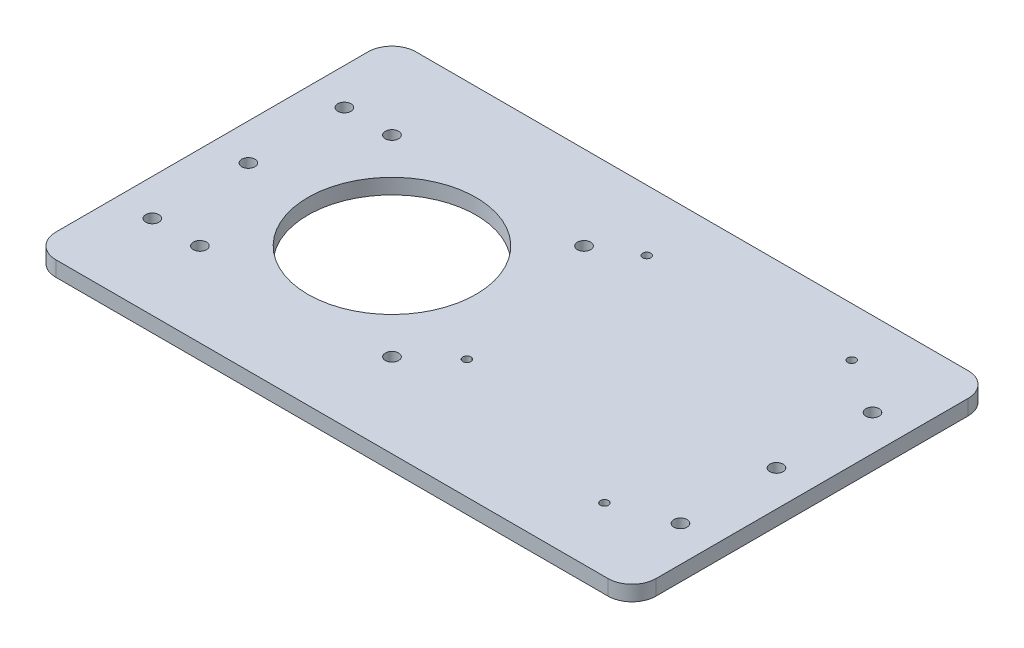
ISO-10303-21;
HEADER;
FILE_DESCRIPTION(('STEP AP214'),'2;1');
FILE_NAME('part.step','',(''),(''),'','','');
FILE_SCHEMA(('AUTOMOTIVE_DESIGN { 1 0 10303 214 1 1 1 1 }'));
ENDSEC;
DATA;
#1=APPLICATION_CONTEXT('core data for automotive mechanical design processes');
#2=APPLICATION_PROTOCOL_DEFINITION('international standard','automotive_design',2000,#1);
#3=PRODUCT_CONTEXT('',#1,'mechanical');
#4=PRODUCT('Part','Part','',(#3));
#5=PRODUCT_RELATED_PRODUCT_CATEGORY('part','',(#4));
#6=PRODUCT_DEFINITION_FORMATION('','',#4);
#7=PRODUCT_DEFINITION_CONTEXT('part definition',#1,'design');
#8=PRODUCT_DEFINITION('design','',#6,#7);
#9=PRODUCT_DEFINITION_SHAPE('','',#8);
#10=(LENGTH_UNIT() NAMED_UNIT(*) SI_UNIT(.MILLI.,.METRE.));
#11=(NAMED_UNIT(*) PLANE_ANGLE_UNIT() SI_UNIT($,.RADIAN.));
#12=(NAMED_UNIT(*) SI_UNIT($,.STERADIAN.) SOLID_ANGLE_UNIT());
#13=UNCERTAINTY_MEASURE_WITH_UNIT(LENGTH_MEASURE(1.E-05),#10,'distance_accuracy_value','');
#14=(GEOMETRIC_REPRESENTATION_CONTEXT(3) GLOBAL_UNCERTAINTY_ASSIGNED_CONTEXT((#13)) GLOBAL_UNIT_ASSIGNED_CONTEXT((#10,
#11,#12)) REPRESENTATION_CONTEXT('',''));
#15=CARTESIAN_POINT('',(0.,0.,0.));
#16=DIRECTION('',(0.,0.,1.));
#17=DIRECTION('',(1.,0.,0.));
#18=AXIS2_PLACEMENT_3D('',#15,#16,#17);
#19=CARTESIAN_POINT('',(-75.,6.35,75.));
#20=DIRECTION('',(1.,0.,0.));
#21=DIRECTION('',(0.,0.,-1.));
#22=AXIS2_PLACEMENT_3D('',#19,#20,#21);
#23=PLANE('',#22);
#24=DIRECTION('',(0.,0.,1.));
#25=VECTOR('',#24,1.);
#26=CARTESIAN_POINT('',(-75.,6.35,75.));
#27=LINE('',#26,#25);
#28=CARTESIAN_POINT('',(-75.,6.35,-65.));
#29=VERTEX_POINT('',#28);
#30=CARTESIAN_POINT('',(-75.,6.35,65.));
#31=VERTEX_POINT('',#30);
#32=EDGE_CURVE('E119',#29,#31,#27,.T.);
#33=ORIENTED_EDGE('',*,*,#32,.F.);
#34=DIRECTION('',(0.,-1.,0.));
#35=VECTOR('',#34,1.);
#36=CARTESIAN_POINT('',(-75.,6.35,-65.));
#37=LINE('',#36,#35);
#38=CARTESIAN_POINT('',(-75.,0.,-65.));
#39=VERTEX_POINT('',#38);
#40=EDGE_CURVE('E104',#29,#39,#37,.T.);
#41=ORIENTED_EDGE('',*,*,#40,.T.);
#42=DIRECTION('',(0.,0.,1.));
#43=VECTOR('',#42,1.);
#44=CARTESIAN_POINT('',(-75.,0.,75.));
#45=LINE('',#44,#43);
#46=CARTESIAN_POINT('',(-75.,0.,65.));
#47=VERTEX_POINT('',#46);
#48=EDGE_CURVE('E116',#39,#47,#45,.T.);
#49=ORIENTED_EDGE('',*,*,#48,.T.);
#50=DIRECTION('',(0.,-1.,0.));
#51=VECTOR('',#50,1.);
#52=CARTESIAN_POINT('',(-75.,6.35,65.));
#53=LINE('',#52,#51);
#54=EDGE_CURVE('E121',#47,#31,#53,.F.);
#55=ORIENTED_EDGE('',*,*,#54,.T.);
#56=EDGE_LOOP('',(#33,#41,#49,#55));
#57=FACE_BOUND('',#56,.T.);
#58=ADVANCED_FACE('F33',(#57),#23,.F.);
#59=CARTESIAN_POINT('',(175.,6.35,75.));
#60=DIRECTION('',(0.,0.,-1.));
#61=DIRECTION('',(-1.,0.,0.));
#62=AXIS2_PLACEMENT_3D('',#59,#60,#61);
#63=PLANE('',#62);
#64=DIRECTION('',(1.,0.,0.));
#65=VECTOR('',#64,1.);
#66=CARTESIAN_POINT('',(175.,6.35,75.));
#67=LINE('',#66,#65);
#68=CARTESIAN_POINT('',(-65.,6.35,75.));
#69=VERTEX_POINT('',#68);
#70=CARTESIAN_POINT('',(165.,6.35,75.));
#71=VERTEX_POINT('',#70);
#72=EDGE_CURVE('E163',#69,#71,#67,.T.);
#73=ORIENTED_EDGE('',*,*,#72,.F.);
#74=DIRECTION('',(0.,-1.,0.));
#75=VECTOR('',#74,1.);
#76=CARTESIAN_POINT('',(-65.,6.35,75.));
#77=LINE('',#76,#75);
#78=CARTESIAN_POINT('',(-65.,0.,75.));
#79=VERTEX_POINT('',#78);
#80=EDGE_CURVE('E11',#69,#79,#77,.T.);
#81=ORIENTED_EDGE('',*,*,#80,.T.);
#82=DIRECTION('',(1.,0.,0.));
#83=VECTOR('',#82,1.);
#84=CARTESIAN_POINT('',(175.,0.,75.));
#85=LINE('',#84,#83);
#86=CARTESIAN_POINT('',(165.,0.,75.));
#87=VERTEX_POINT('',#86);
#88=EDGE_CURVE('E126',#79,#87,#85,.T.);
#89=ORIENTED_EDGE('',*,*,#88,.T.);
#90=DIRECTION('',(0.,-1.,0.));
#91=VECTOR('',#90,1.);
#92=CARTESIAN_POINT('',(165.,6.35,75.));
#93=LINE('',#92,#91);
#94=EDGE_CURVE('E41',#87,#71,#93,.F.);
#95=ORIENTED_EDGE('',*,*,#94,.T.);
#96=EDGE_LOOP('',(#73,#81,#89,#95));
#97=FACE_BOUND('',#96,.T.);
#98=ADVANCED_FACE('F162',(#97),#63,.F.);
#99=CARTESIAN_POINT('',(175.,6.35,75.));
#100=DIRECTION('',(-1.,0.,0.));
#101=DIRECTION('',(0.,0.,1.));
#102=AXIS2_PLACEMENT_3D('',#99,#100,#101);
#103=PLANE('',#102);
#104=DIRECTION('',(0.,0.,-1.));
#105=VECTOR('',#104,1.);
#106=CARTESIAN_POINT('',(175.,0.,75.));
#107=LINE('',#106,#105);
#108=CARTESIAN_POINT('',(175.,0.,65.));
#109=VERTEX_POINT('',#108);
#110=CARTESIAN_POINT('',(175.,0.,-65.));
#111=VERTEX_POINT('',#110);
#112=EDGE_CURVE('E130',#109,#111,#107,.T.);
#113=ORIENTED_EDGE('',*,*,#112,.T.);
#114=DIRECTION('',(0.,-1.,0.));
#115=VECTOR('',#114,1.);
#116=CARTESIAN_POINT('',(175.,6.35,-65.));
#117=LINE('',#116,#115);
#118=CARTESIAN_POINT('',(175.,6.35,-65.));
#119=VERTEX_POINT('',#118);
#120=EDGE_CURVE('E48',#111,#119,#117,.F.);
#121=ORIENTED_EDGE('',*,*,#120,.T.);
#122=DIRECTION('',(0.,0.,-1.));
#123=VECTOR('',#122,1.);
#124=CARTESIAN_POINT('',(175.,6.35,75.));
#125=LINE('',#124,#123);
#126=CARTESIAN_POINT('',(175.,6.35,65.));
#127=VERTEX_POINT('',#126);
#128=EDGE_CURVE('E169',#127,#119,#125,.T.);
#129=ORIENTED_EDGE('',*,*,#128,.F.);
#130=DIRECTION('',(0.,-1.,0.));
#131=VECTOR('',#130,1.);
#132=CARTESIAN_POINT('',(175.,6.35,65.));
#133=LINE('',#132,#131);
#134=EDGE_CURVE('E156',#127,#109,#133,.T.);
#135=ORIENTED_EDGE('',*,*,#134,.T.);
#136=EDGE_LOOP('',(#113,#121,#129,#135));
#137=FACE_BOUND('',#136,.T.);
#138=ADVANCED_FACE('F173',(#137),#103,.F.);
#139=CARTESIAN_POINT('',(175.,6.35,-75.));
#140=DIRECTION('',(0.,0.,1.));
#141=DIRECTION('',(1.,0.,0.));
#142=AXIS2_PLACEMENT_3D('',#139,#140,#141);
#143=PLANE('',#142);
#144=DIRECTION('',(-1.,0.,0.));
#145=VECTOR('',#144,1.);
#146=CARTESIAN_POINT('',(175.,0.,-75.));
#147=LINE('',#146,#145);
#148=CARTESIAN_POINT('',(165.,0.,-75.));
#149=VERTEX_POINT('',#148);
#150=CARTESIAN_POINT('',(-65.,0.,-75.));
#151=VERTEX_POINT('',#150);
#152=EDGE_CURVE('E140',#149,#151,#147,.T.);
#153=ORIENTED_EDGE('',*,*,#152,.T.);
#154=DIRECTION('',(0.,-1.,0.));
#155=VECTOR('',#154,1.);
#156=CARTESIAN_POINT('',(-65.,6.35,-75.));
#157=LINE('',#156,#155);
#158=CARTESIAN_POINT('',(-65.,6.35,-75.));
#159=VERTEX_POINT('',#158);
#160=EDGE_CURVE('E105',#151,#159,#157,.F.);
#161=ORIENTED_EDGE('',*,*,#160,.T.);
#162=DIRECTION('',(-1.,0.,0.));
#163=VECTOR('',#162,1.);
#164=CARTESIAN_POINT('',(175.,6.35,-75.));
#165=LINE('',#164,#163);
#166=CARTESIAN_POINT('',(165.,6.35,-75.));
#167=VERTEX_POINT('',#166);
#168=EDGE_CURVE('E136',#167,#159,#165,.T.);
#169=ORIENTED_EDGE('',*,*,#168,.F.);
#170=DIRECTION('',(0.,-1.,0.));
#171=VECTOR('',#170,1.);
#172=CARTESIAN_POINT('',(165.,6.35,-75.));
#173=LINE('',#172,#171);
#174=EDGE_CURVE('E110',#167,#149,#173,.T.);
#175=ORIENTED_EDGE('',*,*,#174,.T.);
#176=EDGE_LOOP('',(#153,#161,#169,#175));
#177=FACE_BOUND('',#176,.T.);
#178=ADVANCED_FACE('F180',(#177),#143,.F.);
#179=CARTESIAN_POINT('',(0.,6.35,0.));
#180=DIRECTION('',(0.,1.,0.));
#181=DIRECTION('',(0.,0.,1.));
#182=AXIS2_PLACEMENT_3D('',#179,#180,#181);
#183=PLANE('',#182);
#184=CARTESIAN_POINT('',(136.964698881052,6.35,48.452177005734));
#185=DIRECTION('',(0.,-1.,0.));
#186=DIRECTION('',(0.,0.,-1.));
#187=AXIS2_PLACEMENT_3D('',#184,#185,#186);
#188=CIRCLE('',#187,1.70000000000001);
#189=CARTESIAN_POINT('',(136.964698881052,6.35,46.752177005734));
#190=VERTEX_POINT('',#189);
#191=EDGE_CURVE('E290',#190,#190,#188,.T.);
#192=ORIENTED_EDGE('',*,*,#191,.T.);
#193=EDGE_LOOP('',(#192));
#194=FACE_BOUND('',#193,.T.);
#195=CARTESIAN_POINT('',(56.5046988810516,6.35,25.2867157770424));
#196=DIRECTION('',(0.,-1.,0.));
#197=DIRECTION('',(0.,0.,-1.));
#198=AXIS2_PLACEMENT_3D('',#195,#196,#197);
#199=CIRCLE('',#198,1.7);
#200=CARTESIAN_POINT('',(56.5046988810516,6.35,23.5867157770424));
#201=VERTEX_POINT('',#200);
#202=EDGE_CURVE('E281',#201,#201,#199,.T.);
#203=ORIENTED_EDGE('',*,*,#202,.T.);
#204=EDGE_LOOP('',(#203));
#205=FACE_BOUND('',#204,.T.);
#206=CARTESIAN_POINT('',(56.5046988810516,6.35,-49.6132842229576));
#207=DIRECTION('',(0.,-1.,0.));
#208=DIRECTION('',(0.,0.,-1.));
#209=AXIS2_PLACEMENT_3D('',#206,#207,#208);
#210=CIRCLE('',#209,1.7);
#211=CARTESIAN_POINT('',(56.5046988810516,6.35,-51.3132842229576));
#212=VERTEX_POINT('',#211);
#213=EDGE_CURVE('E272',#212,#212,#210,.T.);
#214=ORIENTED_EDGE('',*,*,#213,.T.);
#215=EDGE_LOOP('',(#214));
#216=FACE_BOUND('',#215,.T.);
#217=CARTESIAN_POINT('',(136.964698881052,6.35,-54.547822994266));
#218=DIRECTION('',(0.,-1.,0.));
#219=DIRECTION('',(0.,0.,-1.));
#220=AXIS2_PLACEMENT_3D('',#217,#218,#219);
#221=CIRCLE('',#220,1.70000000000001);
#222=CARTESIAN_POINT('',(136.964698881052,6.35,-56.247822994266));
#223=VERTEX_POINT('',#222);
#224=EDGE_CURVE('E263',#223,#223,#221,.T.);
#225=ORIENTED_EDGE('',*,*,#224,.T.);
#226=EDGE_LOOP('',(#225));
#227=FACE_BOUND('',#226,.T.);
#228=CARTESIAN_POINT('',(-59.8282544944198,6.35,-40.));
#229=DIRECTION('',(0.,-1.,0.));
#230=DIRECTION('',(0.,0.,-1.));
#231=AXIS2_PLACEMENT_3D('',#228,#229,#230);
#232=CIRCLE('',#231,2.75);
#233=CARTESIAN_POINT('',(-59.8282544944198,6.35,-42.75));
#234=VERTEX_POINT('',#233);
#235=EDGE_CURVE('E254',#234,#234,#232,.T.);
#236=ORIENTED_EDGE('',*,*,#235,.T.);
#237=EDGE_LOOP('',(#236));
#238=FACE_BOUND('',#237,.T.);
#239=CARTESIAN_POINT('',(-59.8282544944198,6.35,0.));
#240=DIRECTION('',(0.,-1.,0.));
#241=DIRECTION('',(0.,0.,-1.));
#242=AXIS2_PLACEMENT_3D('',#239,#240,#241);
#243=CIRCLE('',#242,2.75);
#244=CARTESIAN_POINT('',(-59.8282544944198,6.35,-2.75));
#245=VERTEX_POINT('',#244);
#246=EDGE_CURVE('E245',#245,#245,#243,.T.);
#247=ORIENTED_EDGE('',*,*,#246,.T.);
#248=EDGE_LOOP('',(#247));
#249=FACE_BOUND('',#248,.T.);
#250=CARTESIAN_POINT('',(-59.8282544944198,6.35,40.));
#251=DIRECTION('',(0.,-1.,0.));
#252=DIRECTION('',(0.,0.,-1.));
#253=AXIS2_PLACEMENT_3D('',#250,#251,#252);
#254=CIRCLE('',#253,2.75);
#255=CARTESIAN_POINT('',(-59.8282544944198,6.35,37.25));
#256=VERTEX_POINT('',#255);
#257=EDGE_CURVE('E236',#256,#256,#254,.T.);
#258=ORIENTED_EDGE('',*,*,#257,.T.);
#259=EDGE_LOOP('',(#258));
#260=FACE_BOUND('',#259,.T.);
#261=CARTESIAN_POINT('',(160.17174550558,6.35,-40.));
#262=DIRECTION('',(0.,-1.,0.));
#263=DIRECTION('',(0.,0.,-1.));
#264=AXIS2_PLACEMENT_3D('',#261,#262,#263);
#265=CIRCLE('',#264,2.75);
#266=CARTESIAN_POINT('',(160.17174550558,6.35,-42.75));
#267=VERTEX_POINT('',#266);
#268=EDGE_CURVE('E227',#267,#267,#265,.T.);
#269=ORIENTED_EDGE('',*,*,#268,.T.);
#270=EDGE_LOOP('',(#269));
#271=FACE_BOUND('',#270,.T.);
#272=CARTESIAN_POINT('',(160.17174550558,6.35,0.));
#273=DIRECTION('',(0.,-1.,0.));
#274=DIRECTION('',(0.,0.,-1.));
#275=AXIS2_PLACEMENT_3D('',#272,#273,#274);
#276=CIRCLE('',#275,2.75);
#277=CARTESIAN_POINT('',(160.17174550558,6.35,-2.75000000000001));
#278=VERTEX_POINT('',#277);
#279=EDGE_CURVE('E218',#278,#278,#276,.T.);
#280=ORIENTED_EDGE('',*,*,#279,.T.);
#281=EDGE_LOOP('',(#280));
#282=FACE_BOUND('',#281,.T.);
#283=CARTESIAN_POINT('',(160.17174550558,6.35,40.));
#284=DIRECTION('',(0.,-1.,0.));
#285=DIRECTION('',(0.,0.,-1.));
#286=AXIS2_PLACEMENT_3D('',#283,#284,#285);
#287=CIRCLE('',#286,2.75);
#288=CARTESIAN_POINT('',(160.17174550558,6.35,37.25));
#289=VERTEX_POINT('',#288);
#290=EDGE_CURVE('E207',#289,#289,#287,.T.);
#291=ORIENTED_EDGE('',*,*,#290,.T.);
#292=EDGE_LOOP('',(#291));
#293=FACE_BOUND('',#292,.T.);
#294=CARTESIAN_POINT('',(40.,6.35,40.));
#295=DIRECTION('',(0.,1.,0.));
#296=DIRECTION('',(0.,0.,1.));
#297=AXIS2_PLACEMENT_3D('',#294,#295,#296);
#298=CIRCLE('',#297,2.75);
#299=CARTESIAN_POINT('',(40.,6.35,42.75));
#300=VERTEX_POINT('',#299);
#301=EDGE_CURVE('E204',#300,#300,#298,.T.);
#302=ORIENTED_EDGE('',*,*,#301,.F.);
#303=EDGE_LOOP('',(#302));
#304=FACE_BOUND('',#303,.T.);
#305=CARTESIAN_POINT('',(-40.,6.35,40.));
#306=DIRECTION('',(0.,1.,0.));
#307=DIRECTION('',(0.,0.,-1.));
#308=AXIS2_PLACEMENT_3D('',#305,#306,#307);
#309=CIRCLE('',#308,2.75);
#310=CARTESIAN_POINT('',(-40.,6.35,37.25));
#311=VERTEX_POINT('',#310);
#312=EDGE_CURVE('E198',#311,#311,#309,.T.);
#313=ORIENTED_EDGE('',*,*,#312,.F.);
#314=EDGE_LOOP('',(#313));
#315=FACE_BOUND('',#314,.T.);
#316=CARTESIAN_POINT('',(40.,6.35,-40.));
#317=DIRECTION('',(0.,1.,0.));
#318=DIRECTION('',(0.,0.,-1.));
#319=AXIS2_PLACEMENT_3D('',#316,#317,#318);
#320=CIRCLE('',#319,2.75);
#321=CARTESIAN_POINT('',(40.,6.35,-42.75));
#322=VERTEX_POINT('',#321);
#323=EDGE_CURVE('E192',#322,#322,#320,.T.);
#324=ORIENTED_EDGE('',*,*,#323,.F.);
#325=EDGE_LOOP('',(#324));
#326=FACE_BOUND('',#325,.T.);
#327=CARTESIAN_POINT('',(-40.,6.35,-40.));
#328=DIRECTION('',(0.,1.,0.));
#329=DIRECTION('',(0.,0.,1.));
#330=AXIS2_PLACEMENT_3D('',#327,#328,#329);
#331=CIRCLE('',#330,2.75);
#332=CARTESIAN_POINT('',(-40.,6.35,-37.25));
#333=VERTEX_POINT('',#332);
#334=EDGE_CURVE('E186',#333,#333,#331,.T.);
#335=ORIENTED_EDGE('',*,*,#334,.F.);
#336=EDGE_LOOP('',(#335));
#337=FACE_BOUND('',#336,.T.);
#338=CARTESIAN_POINT('',(0.,6.35,0.));
#339=DIRECTION('',(0.,1.,0.));
#340=DIRECTION('',(0.,0.,1.));
#341=AXIS2_PLACEMENT_3D('',#338,#339,#340);
#342=CIRCLE('',#341,35.);
#343=CARTESIAN_POINT('',(0.,6.35,35.));
#344=VERTEX_POINT('',#343);
#345=EDGE_CURVE('E133',#344,#344,#342,.T.);
#346=ORIENTED_EDGE('',*,*,#345,.F.);
#347=EDGE_LOOP('',(#346));
#348=FACE_BOUND('',#347,.T.);
#349=ORIENTED_EDGE('',*,*,#168,.T.);
#350=CARTESIAN_POINT('',(-65.,6.35,-65.));
#351=DIRECTION('',(0.,1.,0.));
#352=DIRECTION('',(0.,0.,1.));
#353=AXIS2_PLACEMENT_3D('',#350,#351,#352);
#354=CIRCLE('',#353,10.);
#355=EDGE_CURVE('E154',#159,#29,#354,.T.);
#356=ORIENTED_EDGE('',*,*,#355,.T.);
#357=ORIENTED_EDGE('',*,*,#32,.T.);
#358=CARTESIAN_POINT('',(-65.,6.35,65.));
#359=DIRECTION('',(0.,1.,0.));
#360=DIRECTION('',(0.,0.,1.));
#361=AXIS2_PLACEMENT_3D('',#358,#359,#360);
#362=CIRCLE('',#361,10.);
#363=EDGE_CURVE('E150',#31,#69,#362,.T.);
#364=ORIENTED_EDGE('',*,*,#363,.T.);
#365=ORIENTED_EDGE('',*,*,#72,.T.);
#366=CARTESIAN_POINT('',(165.,6.35,65.));
#367=DIRECTION('',(0.,1.,0.));
#368=DIRECTION('',(0.,0.,1.));
#369=AXIS2_PLACEMENT_3D('',#366,#367,#368);
#370=CIRCLE('',#369,10.);
#371=EDGE_CURVE('E55',#71,#127,#370,.T.);
#372=ORIENTED_EDGE('',*,*,#371,.T.);
#373=ORIENTED_EDGE('',*,*,#128,.T.);
#374=CARTESIAN_POINT('',(165.,6.35,-65.));
#375=DIRECTION('',(0.,1.,0.));
#376=DIRECTION('',(0.,0.,1.));
#377=AXIS2_PLACEMENT_3D('',#374,#375,#376);
#378=CIRCLE('',#377,10.);
#379=EDGE_CURVE('E152',#119,#167,#378,.T.);
#380=ORIENTED_EDGE('',*,*,#379,.T.);
#381=EDGE_LOOP('',(#349,#356,#357,#364,#365,#372,#373,#380));
#382=FACE_BOUND('',#381,.T.);
#383=ADVANCED_FACE('F167',(#194,#205,#216,#227,#238,#249,#260,#271,#282,#293,#304,#315,#326,
#337,#348,#382),#183,.T.);
#384=CARTESIAN_POINT('',(0.,0.,0.));
#385=DIRECTION('',(0.,1.,0.));
#386=DIRECTION('',(0.,0.,1.));
#387=AXIS2_PLACEMENT_3D('',#384,#385,#386);
#388=PLANE('',#387);
#389=CARTESIAN_POINT('',(136.964698881052,0.,48.452177005734));
#390=DIRECTION('',(0.,-1.,0.));
#391=DIRECTION('',(0.,0.,-1.));
#392=AXIS2_PLACEMENT_3D('',#389,#390,#391);
#393=CIRCLE('',#392,3.14999999999999);
#394=CARTESIAN_POINT('',(136.964698881052,0.,45.302177005734));
#395=VERTEX_POINT('',#394);
#396=EDGE_CURVE('E296',#395,#395,#393,.T.);
#397=ORIENTED_EDGE('',*,*,#396,.F.);
#398=EDGE_LOOP('',(#397));
#399=FACE_BOUND('',#398,.T.);
#400=CARTESIAN_POINT('',(56.5046988810516,0.,25.2867157770424));
#401=DIRECTION('',(0.,-1.,0.));
#402=DIRECTION('',(0.,0.,-1.));
#403=AXIS2_PLACEMENT_3D('',#400,#401,#402);
#404=CIRCLE('',#403,3.15);
#405=CARTESIAN_POINT('',(56.5046988810516,0.,22.1367157770424));
#406=VERTEX_POINT('',#405);
#407=EDGE_CURVE('E287',#406,#406,#404,.T.);
#408=ORIENTED_EDGE('',*,*,#407,.F.);
#409=EDGE_LOOP('',(#408));
#410=FACE_BOUND('',#409,.T.);
#411=CARTESIAN_POINT('',(56.5046988810516,0.,-49.6132842229576));
#412=DIRECTION('',(0.,-1.,0.));
#413=DIRECTION('',(0.,0.,-1.));
#414=AXIS2_PLACEMENT_3D('',#411,#412,#413);
#415=CIRCLE('',#414,3.15);
#416=CARTESIAN_POINT('',(56.5046988810516,0.,-52.7632842229576));
#417=VERTEX_POINT('',#416);
#418=EDGE_CURVE('E278',#417,#417,#415,.T.);
#419=ORIENTED_EDGE('',*,*,#418,.F.);
#420=EDGE_LOOP('',(#419));
#421=FACE_BOUND('',#420,.T.);
#422=CARTESIAN_POINT('',(136.964698881052,0.,-54.547822994266));
#423=DIRECTION('',(0.,-1.,0.));
#424=DIRECTION('',(0.,0.,-1.));
#425=AXIS2_PLACEMENT_3D('',#422,#423,#424);
#426=CIRCLE('',#425,3.14999999999999);
#427=CARTESIAN_POINT('',(136.964698881052,0.,-57.697822994266));
#428=VERTEX_POINT('',#427);
#429=EDGE_CURVE('E269',#428,#428,#426,.T.);
#430=ORIENTED_EDGE('',*,*,#429,.F.);
#431=EDGE_LOOP('',(#430));
#432=FACE_BOUND('',#431,.T.);
#433=CARTESIAN_POINT('',(-59.8282544944198,0.,-40.));
#434=DIRECTION('',(0.,-1.,0.));
#435=DIRECTION('',(0.,0.,-1.));
#436=AXIS2_PLACEMENT_3D('',#433,#434,#435);
#437=CIRCLE('',#436,5.2);
#438=CARTESIAN_POINT('',(-59.8282544944198,0.,-45.2));
#439=VERTEX_POINT('',#438);
#440=EDGE_CURVE('E260',#439,#439,#437,.T.);
#441=ORIENTED_EDGE('',*,*,#440,.F.);
#442=EDGE_LOOP('',(#441));
#443=FACE_BOUND('',#442,.T.);
#444=CARTESIAN_POINT('',(-59.8282544944198,0.,0.));
#445=DIRECTION('',(0.,-1.,0.));
#446=DIRECTION('',(0.,0.,-1.));
#447=AXIS2_PLACEMENT_3D('',#444,#445,#446);
#448=CIRCLE('',#447,5.2);
#449=CARTESIAN_POINT('',(-59.8282544944198,0.,-5.2));
#450=VERTEX_POINT('',#449);
#451=EDGE_CURVE('E251',#450,#450,#448,.T.);
#452=ORIENTED_EDGE('',*,*,#451,.F.);
#453=EDGE_LOOP('',(#452));
#454=FACE_BOUND('',#453,.T.);
#455=CARTESIAN_POINT('',(-59.8282544944198,0.,40.));
#456=DIRECTION('',(0.,-1.,0.));
#457=DIRECTION('',(0.,0.,-1.));
#458=AXIS2_PLACEMENT_3D('',#455,#456,#457);
#459=CIRCLE('',#458,5.2);
#460=CARTESIAN_POINT('',(-59.8282544944198,0.,34.8));
#461=VERTEX_POINT('',#460);
#462=EDGE_CURVE('E242',#461,#461,#459,.T.);
#463=ORIENTED_EDGE('',*,*,#462,.F.);
#464=EDGE_LOOP('',(#463));
#465=FACE_BOUND('',#464,.T.);
#466=CARTESIAN_POINT('',(160.17174550558,0.,-40.));
#467=DIRECTION('',(0.,-1.,0.));
#468=DIRECTION('',(0.,0.,-1.));
#469=AXIS2_PLACEMENT_3D('',#466,#467,#468);
#470=CIRCLE('',#469,5.20000000000001);
#471=CARTESIAN_POINT('',(160.17174550558,0.,-45.2));
#472=VERTEX_POINT('',#471);
#473=EDGE_CURVE('E233',#472,#472,#470,.T.);
#474=ORIENTED_EDGE('',*,*,#473,.F.);
#475=EDGE_LOOP('',(#474));
#476=FACE_BOUND('',#475,.T.);
#477=CARTESIAN_POINT('',(160.17174550558,0.,0.));
#478=DIRECTION('',(0.,-1.,0.));
#479=DIRECTION('',(0.,0.,-1.));
#480=AXIS2_PLACEMENT_3D('',#477,#478,#479);
#481=CIRCLE('',#480,5.20000000000001);
#482=CARTESIAN_POINT('',(160.17174550558,0.,-5.20000000000002));
#483=VERTEX_POINT('',#482);
#484=EDGE_CURVE('E224',#483,#483,#481,.T.);
#485=ORIENTED_EDGE('',*,*,#484,.F.);
#486=EDGE_LOOP('',(#485));
#487=FACE_BOUND('',#486,.T.);
#488=CARTESIAN_POINT('',(160.17174550558,0.,40.));
#489=DIRECTION('',(0.,-1.,0.));
#490=DIRECTION('',(0.,0.,-1.));
#491=AXIS2_PLACEMENT_3D('',#488,#489,#490);
#492=CIRCLE('',#491,5.20000000000001);
#493=CARTESIAN_POINT('',(160.17174550558,0.,34.8));
#494=VERTEX_POINT('',#493);
#495=EDGE_CURVE('E215',#494,#494,#492,.T.);
#496=ORIENTED_EDGE('',*,*,#495,.F.);
#497=EDGE_LOOP('',(#496));
#498=FACE_BOUND('',#497,.T.);
#499=CARTESIAN_POINT('',(40.,0.,40.));
#500=DIRECTION('',(0.,1.,0.));
#501=DIRECTION('',(0.,0.,1.));
#502=AXIS2_PLACEMENT_3D('',#499,#500,#501);
#503=CIRCLE('',#502,2.75);
#504=CARTESIAN_POINT('',(40.,0.,42.75));
#505=VERTEX_POINT('',#504);
#506=EDGE_CURVE('E201',#505,#505,#503,.T.);
#507=ORIENTED_EDGE('',*,*,#506,.T.);
#508=EDGE_LOOP('',(#507));
#509=FACE_BOUND('',#508,.T.);
#510=CARTESIAN_POINT('',(-40.,0.,40.));
#511=DIRECTION('',(0.,1.,0.));
#512=DIRECTION('',(0.,0.,-1.));
#513=AXIS2_PLACEMENT_3D('',#510,#511,#512);
#514=CIRCLE('',#513,2.75);
#515=CARTESIAN_POINT('',(-40.,0.,37.25));
#516=VERTEX_POINT('',#515);
#517=EDGE_CURVE('E195',#516,#516,#514,.T.);
#518=ORIENTED_EDGE('',*,*,#517,.T.);
#519=EDGE_LOOP('',(#518));
#520=FACE_BOUND('',#519,.T.);
#521=CARTESIAN_POINT('',(40.,0.,-40.));
#522=DIRECTION('',(0.,1.,0.));
#523=DIRECTION('',(0.,0.,-1.));
#524=AXIS2_PLACEMENT_3D('',#521,#522,#523);
#525=CIRCLE('',#524,2.75);
#526=CARTESIAN_POINT('',(40.,0.,-42.75));
#527=VERTEX_POINT('',#526);
#528=EDGE_CURVE('E189',#527,#527,#525,.T.);
#529=ORIENTED_EDGE('',*,*,#528,.T.);
#530=EDGE_LOOP('',(#529));
#531=FACE_BOUND('',#530,.T.);
#532=CARTESIAN_POINT('',(-40.,0.,-40.));
#533=DIRECTION('',(0.,1.,0.));
#534=DIRECTION('',(0.,0.,1.));
#535=AXIS2_PLACEMENT_3D('',#532,#533,#534);
#536=CIRCLE('',#535,2.75);
#537=CARTESIAN_POINT('',(-40.,0.,-37.25));
#538=VERTEX_POINT('',#537);
#539=EDGE_CURVE('E184',#538,#538,#536,.T.);
#540=ORIENTED_EDGE('',*,*,#539,.T.);
#541=EDGE_LOOP('',(#540));
#542=FACE_BOUND('',#541,.T.);
#543=CARTESIAN_POINT('',(0.,0.,0.));
#544=DIRECTION('',(0.,1.,0.));
#545=DIRECTION('',(0.,0.,1.));
#546=AXIS2_PLACEMENT_3D('',#543,#544,#545);
#547=CIRCLE('',#546,35.);
#548=CARTESIAN_POINT('',(0.,0.,35.));
#549=VERTEX_POINT('',#548);
#550=EDGE_CURVE('E127',#549,#549,#547,.T.);
#551=ORIENTED_EDGE('',*,*,#550,.T.);
#552=EDGE_LOOP('',(#551));
#553=FACE_BOUND('',#552,.T.);
#554=ORIENTED_EDGE('',*,*,#48,.F.);
#555=CARTESIAN_POINT('',(-65.,0.,-65.));
#556=DIRECTION('',(0.,1.,0.));
#557=DIRECTION('',(0.,0.,1.));
#558=AXIS2_PLACEMENT_3D('',#555,#556,#557);
#559=CIRCLE('',#558,10.);
#560=EDGE_CURVE('E100',#39,#151,#559,.F.);
#561=ORIENTED_EDGE('',*,*,#560,.T.);
#562=ORIENTED_EDGE('',*,*,#152,.F.);
#563=CARTESIAN_POINT('',(165.,0.,-65.));
#564=DIRECTION('',(0.,1.,0.));
#565=DIRECTION('',(0.,0.,1.));
#566=AXIS2_PLACEMENT_3D('',#563,#564,#565);
#567=CIRCLE('',#566,10.);
#568=EDGE_CURVE('E111',#149,#111,#567,.F.);
#569=ORIENTED_EDGE('',*,*,#568,.T.);
#570=ORIENTED_EDGE('',*,*,#112,.F.);
#571=CARTESIAN_POINT('',(165.,0.,65.));
#572=DIRECTION('',(0.,1.,0.));
#573=DIRECTION('',(0.,0.,1.));
#574=AXIS2_PLACEMENT_3D('',#571,#572,#573);
#575=CIRCLE('',#574,10.);
#576=EDGE_CURVE('E120',#109,#87,#575,.F.);
#577=ORIENTED_EDGE('',*,*,#576,.T.);
#578=ORIENTED_EDGE('',*,*,#88,.F.);
#579=CARTESIAN_POINT('',(-65.,0.,65.));
#580=DIRECTION('',(0.,1.,0.));
#581=DIRECTION('',(0.,0.,1.));
#582=AXIS2_PLACEMENT_3D('',#579,#580,#581);
#583=CIRCLE('',#582,10.);
#584=EDGE_CURVE('E125',#79,#47,#583,.F.);
#585=ORIENTED_EDGE('',*,*,#584,.T.);
#586=EDGE_LOOP('',(#554,#561,#562,#569,#570,#577,#578,#585));
#587=FACE_BOUND('',#586,.T.);
#588=ADVANCED_FACE('F123',(#399,#410,#421,#432,#443,#454,#465,#476,#487,#498,#509,#520,#531,
#542,#553,#587),#388,.F.);
#589=CARTESIAN_POINT('',(0.,0.,0.));
#590=DIRECTION('',(0.,1.,0.));
#591=DIRECTION('',(0.,0.,1.));
#592=AXIS2_PLACEMENT_3D('',#589,#590,#591);
#593=CYLINDRICAL_SURFACE('',#592,35.);
#594=ORIENTED_EDGE('',*,*,#550,.F.);
#595=EDGE_LOOP('',(#594));
#596=FACE_BOUND('',#595,.T.);
#597=ORIENTED_EDGE('',*,*,#345,.T.);
#598=EDGE_LOOP('',(#597));
#599=FACE_BOUND('',#598,.T.);
#600=ADVANCED_FACE('F304',(#596,#599),#593,.F.);
#601=CARTESIAN_POINT('',(-40.,0.,-40.));
#602=DIRECTION('',(0.,1.,0.));
#603=DIRECTION('',(0.,0.,1.));
#604=AXIS2_PLACEMENT_3D('',#601,#602,#603);
#605=CYLINDRICAL_SURFACE('',#604,2.75);
#606=ORIENTED_EDGE('',*,*,#539,.F.);
#607=EDGE_LOOP('',(#606));
#608=FACE_BOUND('',#607,.T.);
#609=ORIENTED_EDGE('',*,*,#334,.T.);
#610=EDGE_LOOP('',(#609));
#611=FACE_BOUND('',#610,.T.);
#612=ADVANCED_FACE('F336',(#608,#611),#605,.F.);
#613=CARTESIAN_POINT('',(40.,0.,-40.));
#614=DIRECTION('',(0.,1.,0.));
#615=DIRECTION('',(0.,0.,1.));
#616=AXIS2_PLACEMENT_3D('',#613,#614,#615);
#617=CYLINDRICAL_SURFACE('',#616,2.75);
#618=ORIENTED_EDGE('',*,*,#528,.F.);
#619=EDGE_LOOP('',(#618));
#620=FACE_BOUND('',#619,.T.);
#621=ORIENTED_EDGE('',*,*,#323,.T.);
#622=EDGE_LOOP('',(#621));
#623=FACE_BOUND('',#622,.T.);
#624=ADVANCED_FACE('F389',(#620,#623),#617,.F.);
#625=CARTESIAN_POINT('',(-40.,0.,40.));
#626=DIRECTION('',(0.,1.,0.));
#627=DIRECTION('',(0.,0.,1.));
#628=AXIS2_PLACEMENT_3D('',#625,#626,#627);
#629=CYLINDRICAL_SURFACE('',#628,2.75);
#630=ORIENTED_EDGE('',*,*,#517,.F.);
#631=EDGE_LOOP('',(#630));
#632=FACE_BOUND('',#631,.T.);
#633=ORIENTED_EDGE('',*,*,#312,.T.);
#634=EDGE_LOOP('',(#633));
#635=FACE_BOUND('',#634,.T.);
#636=ADVANCED_FACE('F385',(#632,#635),#629,.F.);
#637=CARTESIAN_POINT('',(40.,0.,40.));
#638=DIRECTION('',(0.,1.,0.));
#639=DIRECTION('',(0.,0.,1.));
#640=AXIS2_PLACEMENT_3D('',#637,#638,#639);
#641=CYLINDRICAL_SURFACE('',#640,2.75);
#642=ORIENTED_EDGE('',*,*,#506,.F.);
#643=EDGE_LOOP('',(#642));
#644=FACE_BOUND('',#643,.T.);
#645=ORIENTED_EDGE('',*,*,#301,.T.);
#646=EDGE_LOOP('',(#645));
#647=FACE_BOUND('',#646,.T.);
#648=ADVANCED_FACE('F358',(#644,#647),#641,.F.);
#649=CARTESIAN_POINT('',(-65.,6.35,-65.));
#650=DIRECTION('',(0.,-1.,0.));
#651=DIRECTION('',(0.,0.,-1.));
#652=AXIS2_PLACEMENT_3D('',#649,#650,#651);
#653=CYLINDRICAL_SURFACE('',#652,10.);
#654=ORIENTED_EDGE('',*,*,#355,.F.);
#655=ORIENTED_EDGE('',*,*,#160,.F.);
#656=ORIENTED_EDGE('',*,*,#560,.F.);
#657=ORIENTED_EDGE('',*,*,#40,.F.);
#658=EDGE_LOOP('',(#654,#655,#656,#657));
#659=FACE_BOUND('',#658,.T.);
#660=ADVANCED_FACE('F103',(#659),#653,.T.);
#661=CARTESIAN_POINT('',(165.,6.35,-65.));
#662=DIRECTION('',(0.,-1.,0.));
#663=DIRECTION('',(0.,0.,-1.));
#664=AXIS2_PLACEMENT_3D('',#661,#662,#663);
#665=CYLINDRICAL_SURFACE('',#664,10.);
#666=ORIENTED_EDGE('',*,*,#379,.F.);
#667=ORIENTED_EDGE('',*,*,#120,.F.);
#668=ORIENTED_EDGE('',*,*,#568,.F.);
#669=ORIENTED_EDGE('',*,*,#174,.F.);
#670=EDGE_LOOP('',(#666,#667,#668,#669));
#671=FACE_BOUND('',#670,.T.);
#672=ADVANCED_FACE('F177',(#671),#665,.T.);
#673=CARTESIAN_POINT('',(-65.,6.35,65.));
#674=DIRECTION('',(0.,-1.,0.));
#675=DIRECTION('',(0.,0.,-1.));
#676=AXIS2_PLACEMENT_3D('',#673,#674,#675);
#677=CYLINDRICAL_SURFACE('',#676,10.);
#678=ORIENTED_EDGE('',*,*,#363,.F.);
#679=ORIENTED_EDGE('',*,*,#54,.F.);
#680=ORIENTED_EDGE('',*,*,#584,.F.);
#681=ORIENTED_EDGE('',*,*,#80,.F.);
#682=EDGE_LOOP('',(#678,#679,#680,#681));
#683=FACE_BOUND('',#682,.T.);
#684=ADVANCED_FACE('F360',(#683),#677,.T.);
#685=CARTESIAN_POINT('',(165.,6.35,65.));
#686=DIRECTION('',(0.,-1.,0.));
#687=DIRECTION('',(0.,0.,-1.));
#688=AXIS2_PLACEMENT_3D('',#685,#686,#687);
#689=CYLINDRICAL_SURFACE('',#688,10.);
#690=ORIENTED_EDGE('',*,*,#371,.F.);
#691=ORIENTED_EDGE('',*,*,#94,.F.);
#692=ORIENTED_EDGE('',*,*,#576,.F.);
#693=ORIENTED_EDGE('',*,*,#134,.F.);
#694=EDGE_LOOP('',(#690,#691,#692,#693));
#695=FACE_BOUND('',#694,.T.);
#696=ADVANCED_FACE('F35',(#695),#689,.T.);
#697=CARTESIAN_POINT('',(160.17174550558,0.,40.));
#698=DIRECTION('',(0.,-1.,0.));
#699=DIRECTION('',(0.,0.,-1.));
#700=AXIS2_PLACEMENT_3D('',#697,#698,#699);
#701=CYLINDRICAL_SURFACE('',#700,2.75);
#702=ORIENTED_EDGE('',*,*,#290,.F.);
#703=EDGE_LOOP('',(#702));
#704=FACE_BOUND('',#703,.T.);
#705=CARTESIAN_POINT('',(160.17174550558,2.45,40.));
#706=DIRECTION('',(0.,-1.,0.));
#707=DIRECTION('',(0.,0.,-1.));
#708=AXIS2_PLACEMENT_3D('',#705,#706,#707);
#709=CIRCLE('',#708,2.75);
#710=CARTESIAN_POINT('',(160.17174550558,2.45,37.25));
#711=VERTEX_POINT('',#710);
#712=EDGE_CURVE('E212',#711,#711,#709,.T.);
#713=ORIENTED_EDGE('',*,*,#712,.T.);
#714=EDGE_LOOP('',(#713));
#715=FACE_BOUND('',#714,.T.);
#716=ADVANCED_FACE('F366',(#704,#715),#701,.F.);
#717=CARTESIAN_POINT('',(160.17174550558,0.,40.));
#718=DIRECTION('',(0.,-1.,0.));
#719=DIRECTION('',(0.,0.,-1.));
#720=AXIS2_PLACEMENT_3D('',#717,#718,#719);
#721=CONICAL_SURFACE('',#720,5.20000000000001,0.78539816339745);
#722=ORIENTED_EDGE('',*,*,#712,.F.);
#723=EDGE_LOOP('',(#722));
#724=FACE_BOUND('',#723,.T.);
#725=ORIENTED_EDGE('',*,*,#495,.T.);
#726=EDGE_LOOP('',(#725));
#727=FACE_BOUND('',#726,.T.);
#728=ADVANCED_FACE('F370',(#724,#727),#721,.F.);
#729=CARTESIAN_POINT('',(160.17174550558,0.,0.));
#730=DIRECTION('',(0.,-1.,0.));
#731=DIRECTION('',(0.,0.,-1.));
#732=AXIS2_PLACEMENT_3D('',#729,#730,#731);
#733=CYLINDRICAL_SURFACE('',#732,2.75);
#734=ORIENTED_EDGE('',*,*,#279,.F.);
#735=EDGE_LOOP('',(#734));
#736=FACE_BOUND('',#735,.T.);
#737=CARTESIAN_POINT('',(160.17174550558,2.45,0.));
#738=DIRECTION('',(0.,-1.,0.));
#739=DIRECTION('',(0.,0.,-1.));
#740=AXIS2_PLACEMENT_3D('',#737,#738,#739);
#741=CIRCLE('',#740,2.75);
#742=CARTESIAN_POINT('',(160.17174550558,2.45,-2.75000000000001));
#743=VERTEX_POINT('',#742);
#744=EDGE_CURVE('E221',#743,#743,#741,.T.);
#745=ORIENTED_EDGE('',*,*,#744,.T.);
#746=EDGE_LOOP('',(#745));
#747=FACE_BOUND('',#746,.T.);
#748=ADVANCED_FACE('F376',(#736,#747),#733,.F.);
#749=CARTESIAN_POINT('',(160.17174550558,0.,0.));
#750=DIRECTION('',(0.,-1.,0.));
#751=DIRECTION('',(0.,0.,-1.));
#752=AXIS2_PLACEMENT_3D('',#749,#750,#751);
#753=CONICAL_SURFACE('',#752,5.20000000000001,0.78539816339745);
#754=ORIENTED_EDGE('',*,*,#744,.F.);
#755=EDGE_LOOP('',(#754));
#756=FACE_BOUND('',#755,.T.);
#757=ORIENTED_EDGE('',*,*,#484,.T.);
#758=EDGE_LOOP('',(#757));
#759=FACE_BOUND('',#758,.T.);
#760=ADVANCED_FACE('F451',(#756,#759),#753,.F.);
#761=CARTESIAN_POINT('',(160.17174550558,0.,-40.));
#762=DIRECTION('',(0.,-1.,0.));
#763=DIRECTION('',(0.,0.,-1.));
#764=AXIS2_PLACEMENT_3D('',#761,#762,#763);
#765=CYLINDRICAL_SURFACE('',#764,2.75);
#766=ORIENTED_EDGE('',*,*,#268,.F.);
#767=EDGE_LOOP('',(#766));
#768=FACE_BOUND('',#767,.T.);
#769=CARTESIAN_POINT('',(160.17174550558,2.45,-40.));
#770=DIRECTION('',(0.,-1.,0.));
#771=DIRECTION('',(0.,0.,-1.));
#772=AXIS2_PLACEMENT_3D('',#769,#770,#771);
#773=CIRCLE('',#772,2.75);
#774=CARTESIAN_POINT('',(160.17174550558,2.45,-42.75));
#775=VERTEX_POINT('',#774);
#776=EDGE_CURVE('E230',#775,#775,#773,.T.);
#777=ORIENTED_EDGE('',*,*,#776,.T.);
#778=EDGE_LOOP('',(#777));
#779=FACE_BOUND('',#778,.T.);
#780=ADVANCED_FACE('F460',(#768,#779),#765,.F.);
#781=CARTESIAN_POINT('',(160.17174550558,0.,-40.));
#782=DIRECTION('',(0.,-1.,0.));
#783=DIRECTION('',(0.,0.,-1.));
#784=AXIS2_PLACEMENT_3D('',#781,#782,#783);
#785=CONICAL_SURFACE('',#784,5.20000000000001,0.78539816339745);
#786=ORIENTED_EDGE('',*,*,#776,.F.);
#787=EDGE_LOOP('',(#786));
#788=FACE_BOUND('',#787,.T.);
#789=ORIENTED_EDGE('',*,*,#473,.T.);
#790=EDGE_LOOP('',(#789));
#791=FACE_BOUND('',#790,.T.);
#792=ADVANCED_FACE('F470',(#788,#791),#785,.F.);
#793=CARTESIAN_POINT('',(-59.8282544944198,0.,40.));
#794=DIRECTION('',(0.,-1.,0.));
#795=DIRECTION('',(0.,0.,-1.));
#796=AXIS2_PLACEMENT_3D('',#793,#794,#795);
#797=CYLINDRICAL_SURFACE('',#796,2.75);
#798=ORIENTED_EDGE('',*,*,#257,.F.);
#799=EDGE_LOOP('',(#798));
#800=FACE_BOUND('',#799,.T.);
#801=CARTESIAN_POINT('',(-59.8282544944198,2.45,40.));
#802=DIRECTION('',(0.,-1.,0.));
#803=DIRECTION('',(0.,0.,-1.));
#804=AXIS2_PLACEMENT_3D('',#801,#802,#803);
#805=CIRCLE('',#804,2.75);
#806=CARTESIAN_POINT('',(-59.8282544944198,2.45,37.25));
#807=VERTEX_POINT('',#806);
#808=EDGE_CURVE('E239',#807,#807,#805,.T.);
#809=ORIENTED_EDGE('',*,*,#808,.T.);
#810=EDGE_LOOP('',(#809));
#811=FACE_BOUND('',#810,.T.);
#812=ADVANCED_FACE('F480',(#800,#811),#797,.F.);
#813=CARTESIAN_POINT('',(-59.8282544944198,0.,40.));
#814=DIRECTION('',(0.,-1.,0.));
#815=DIRECTION('',(0.,0.,-1.));
#816=AXIS2_PLACEMENT_3D('',#813,#814,#815);
#817=CONICAL_SURFACE('',#816,5.2,0.785398163397449);
#818=ORIENTED_EDGE('',*,*,#808,.F.);
#819=EDGE_LOOP('',(#818));
#820=FACE_BOUND('',#819,.T.);
#821=ORIENTED_EDGE('',*,*,#462,.T.);
#822=EDGE_LOOP('',(#821));
#823=FACE_BOUND('',#822,.T.);
#824=ADVANCED_FACE('F490',(#820,#823),#817,.F.);
#825=CARTESIAN_POINT('',(-59.8282544944198,0.,0.));
#826=DIRECTION('',(0.,-1.,0.));
#827=DIRECTION('',(0.,0.,-1.));
#828=AXIS2_PLACEMENT_3D('',#825,#826,#827);
#829=CYLINDRICAL_SURFACE('',#828,2.75);
#830=ORIENTED_EDGE('',*,*,#246,.F.);
#831=EDGE_LOOP('',(#830));
#832=FACE_BOUND('',#831,.T.);
#833=CARTESIAN_POINT('',(-59.8282544944198,2.45,0.));
#834=DIRECTION('',(0.,-1.,0.));
#835=DIRECTION('',(0.,0.,-1.));
#836=AXIS2_PLACEMENT_3D('',#833,#834,#835);
#837=CIRCLE('',#836,2.75);
#838=CARTESIAN_POINT('',(-59.8282544944198,2.45,-2.75));
#839=VERTEX_POINT('',#838);
#840=EDGE_CURVE('E248',#839,#839,#837,.T.);
#841=ORIENTED_EDGE('',*,*,#840,.T.);
#842=EDGE_LOOP('',(#841));
#843=FACE_BOUND('',#842,.T.);
#844=ADVANCED_FACE('F500',(#832,#843),#829,.F.);
#845=CARTESIAN_POINT('',(-59.8282544944198,0.,0.));
#846=DIRECTION('',(0.,-1.,0.));
#847=DIRECTION('',(0.,0.,-1.));
#848=AXIS2_PLACEMENT_3D('',#845,#846,#847);
#849=CONICAL_SURFACE('',#848,5.2,0.785398163397449);
#850=ORIENTED_EDGE('',*,*,#840,.F.);
#851=EDGE_LOOP('',(#850));
#852=FACE_BOUND('',#851,.T.);
#853=ORIENTED_EDGE('',*,*,#451,.T.);
#854=EDGE_LOOP('',(#853));
#855=FACE_BOUND('',#854,.T.);
#856=ADVANCED_FACE('F510',(#852,#855),#849,.F.);
#857=CARTESIAN_POINT('',(-59.8282544944198,0.,-40.));
#858=DIRECTION('',(0.,-1.,0.));
#859=DIRECTION('',(0.,0.,-1.));
#860=AXIS2_PLACEMENT_3D('',#857,#858,#859);
#861=CYLINDRICAL_SURFACE('',#860,2.75);
#862=ORIENTED_EDGE('',*,*,#235,.F.);
#863=EDGE_LOOP('',(#862));
#864=FACE_BOUND('',#863,.T.);
#865=CARTESIAN_POINT('',(-59.8282544944198,2.45,-40.));
#866=DIRECTION('',(0.,-1.,0.));
#867=DIRECTION('',(0.,0.,-1.));
#868=AXIS2_PLACEMENT_3D('',#865,#866,#867);
#869=CIRCLE('',#868,2.75);
#870=CARTESIAN_POINT('',(-59.8282544944198,2.45,-42.75));
#871=VERTEX_POINT('',#870);
#872=EDGE_CURVE('E257',#871,#871,#869,.T.);
#873=ORIENTED_EDGE('',*,*,#872,.T.);
#874=EDGE_LOOP('',(#873));
#875=FACE_BOUND('',#874,.T.);
#876=ADVANCED_FACE('F520',(#864,#875),#861,.F.);
#877=CARTESIAN_POINT('',(-59.8282544944198,0.,-40.));
#878=DIRECTION('',(0.,-1.,0.));
#879=DIRECTION('',(0.,0.,-1.));
#880=AXIS2_PLACEMENT_3D('',#877,#878,#879);
#881=CONICAL_SURFACE('',#880,5.2,0.785398163397449);
#882=ORIENTED_EDGE('',*,*,#872,.F.);
#883=EDGE_LOOP('',(#882));
#884=FACE_BOUND('',#883,.T.);
#885=ORIENTED_EDGE('',*,*,#440,.T.);
#886=EDGE_LOOP('',(#885));
#887=FACE_BOUND('',#886,.T.);
#888=ADVANCED_FACE('F530',(#884,#887),#881,.F.);
#889=CARTESIAN_POINT('',(136.964698881052,0.,-54.547822994266));
#890=DIRECTION('',(0.,-1.,0.));
#891=DIRECTION('',(0.,0.,-1.));
#892=AXIS2_PLACEMENT_3D('',#889,#890,#891);
#893=CYLINDRICAL_SURFACE('',#892,1.70000000000001);
#894=ORIENTED_EDGE('',*,*,#224,.F.);
#895=EDGE_LOOP('',(#894));
#896=FACE_BOUND('',#895,.T.);
#897=CARTESIAN_POINT('',(136.964698881052,1.45,-54.547822994266));
#898=DIRECTION('',(0.,-1.,0.));
#899=DIRECTION('',(0.,0.,-1.));
#900=AXIS2_PLACEMENT_3D('',#897,#898,#899);
#901=CIRCLE('',#900,1.70000000000001);
#902=CARTESIAN_POINT('',(136.964698881052,1.45,-56.247822994266));
#903=VERTEX_POINT('',#902);
#904=EDGE_CURVE('E266',#903,#903,#901,.T.);
#905=ORIENTED_EDGE('',*,*,#904,.T.);
#906=EDGE_LOOP('',(#905));
#907=FACE_BOUND('',#906,.T.);
#908=ADVANCED_FACE('F539',(#896,#907),#893,.F.);
#909=CARTESIAN_POINT('',(136.964698881052,0.,-54.547822994266));
#910=DIRECTION('',(0.,-1.,0.));
#911=DIRECTION('',(0.,0.,-1.));
#912=AXIS2_PLACEMENT_3D('',#909,#910,#911);
#913=CONICAL_SURFACE('',#912,3.14999999999999,0.785398163397441);
#914=ORIENTED_EDGE('',*,*,#904,.F.);
#915=EDGE_LOOP('',(#914));
#916=FACE_BOUND('',#915,.T.);
#917=ORIENTED_EDGE('',*,*,#429,.T.);
#918=EDGE_LOOP('',(#917));
#919=FACE_BOUND('',#918,.T.);
#920=ADVANCED_FACE('F562',(#916,#919),#913,.F.);
#921=CARTESIAN_POINT('',(56.5046988810516,0.,-49.6132842229576));
#922=DIRECTION('',(0.,-1.,0.));
#923=DIRECTION('',(0.,0.,-1.));
#924=AXIS2_PLACEMENT_3D('',#921,#922,#923);
#925=CYLINDRICAL_SURFACE('',#924,1.7);
#926=ORIENTED_EDGE('',*,*,#213,.F.);
#927=EDGE_LOOP('',(#926));
#928=FACE_BOUND('',#927,.T.);
#929=CARTESIAN_POINT('',(56.5046988810516,1.45,-49.6132842229576));
#930=DIRECTION('',(0.,-1.,0.));
#931=DIRECTION('',(0.,0.,-1.));
#932=AXIS2_PLACEMENT_3D('',#929,#930,#931);
#933=CIRCLE('',#932,1.7);
#934=CARTESIAN_POINT('',(56.5046988810516,1.45,-51.3132842229576));
#935=VERTEX_POINT('',#934);
#936=EDGE_CURVE('E275',#935,#935,#933,.T.);
#937=ORIENTED_EDGE('',*,*,#936,.T.);
#938=EDGE_LOOP('',(#937));
#939=FACE_BOUND('',#938,.T.);
#940=ADVANCED_FACE('F572',(#928,#939),#925,.F.);
#941=CARTESIAN_POINT('',(56.5046988810516,0.,-49.6132842229576));
#942=DIRECTION('',(0.,-1.,0.));
#943=DIRECTION('',(0.,0.,-1.));
#944=AXIS2_PLACEMENT_3D('',#941,#942,#943);
#945=CONICAL_SURFACE('',#944,3.15,0.785398163397448);
#946=ORIENTED_EDGE('',*,*,#936,.F.);
#947=EDGE_LOOP('',(#946));
#948=FACE_BOUND('',#947,.T.);
#949=ORIENTED_EDGE('',*,*,#418,.T.);
#950=EDGE_LOOP('',(#949));
#951=FACE_BOUND('',#950,.T.);
#952=ADVANCED_FACE('F582',(#948,#951),#945,.F.);
#953=CARTESIAN_POINT('',(56.5046988810516,0.,25.2867157770424));
#954=DIRECTION('',(0.,-1.,0.));
#955=DIRECTION('',(0.,0.,-1.));
#956=AXIS2_PLACEMENT_3D('',#953,#954,#955);
#957=CYLINDRICAL_SURFACE('',#956,1.7);
#958=ORIENTED_EDGE('',*,*,#202,.F.);
#959=EDGE_LOOP('',(#958));
#960=FACE_BOUND('',#959,.T.);
#961=CARTESIAN_POINT('',(56.5046988810516,1.45,25.2867157770424));
#962=DIRECTION('',(0.,-1.,0.));
#963=DIRECTION('',(0.,0.,-1.));
#964=AXIS2_PLACEMENT_3D('',#961,#962,#963);
#965=CIRCLE('',#964,1.7);
#966=CARTESIAN_POINT('',(56.5046988810516,1.45,23.5867157770424));
#967=VERTEX_POINT('',#966);
#968=EDGE_CURVE('E284',#967,#967,#965,.T.);
#969=ORIENTED_EDGE('',*,*,#968,.T.);
#970=EDGE_LOOP('',(#969));
#971=FACE_BOUND('',#970,.T.);
#972=ADVANCED_FACE('F592',(#960,#971),#957,.F.);
#973=CARTESIAN_POINT('',(56.5046988810516,0.,25.2867157770424));
#974=DIRECTION('',(0.,-1.,0.));
#975=DIRECTION('',(0.,0.,-1.));
#976=AXIS2_PLACEMENT_3D('',#973,#974,#975);
#977=CONICAL_SURFACE('',#976,3.15,0.785398163397448);
#978=ORIENTED_EDGE('',*,*,#968,.F.);
#979=EDGE_LOOP('',(#978));
#980=FACE_BOUND('',#979,.T.);
#981=ORIENTED_EDGE('',*,*,#407,.T.);
#982=EDGE_LOOP('',(#981));
#983=FACE_BOUND('',#982,.T.);
#984=ADVANCED_FACE('F602',(#980,#983),#977,.F.);
#985=CARTESIAN_POINT('',(136.964698881052,0.,48.452177005734));
#986=DIRECTION('',(0.,-1.,0.));
#987=DIRECTION('',(0.,0.,-1.));
#988=AXIS2_PLACEMENT_3D('',#985,#986,#987);
#989=CYLINDRICAL_SURFACE('',#988,1.70000000000001);
#990=ORIENTED_EDGE('',*,*,#191,.F.);
#991=EDGE_LOOP('',(#990));
#992=FACE_BOUND('',#991,.T.);
#993=CARTESIAN_POINT('',(136.964698881052,1.45,48.452177005734));
#994=DIRECTION('',(0.,-1.,0.));
#995=DIRECTION('',(0.,0.,-1.));
#996=AXIS2_PLACEMENT_3D('',#993,#994,#995);
#997=CIRCLE('',#996,1.70000000000001);
#998=CARTESIAN_POINT('',(136.964698881052,1.45,46.752177005734));
#999=VERTEX_POINT('',#998);
#1000=EDGE_CURVE('E293',#999,#999,#997,.T.);
#1001=ORIENTED_EDGE('',*,*,#1000,.T.);
#1002=EDGE_LOOP('',(#1001));
#1003=FACE_BOUND('',#1002,.T.);
#1004=ADVANCED_FACE('F612',(#992,#1003),#989,.F.);
#1005=CARTESIAN_POINT('',(136.964698881052,0.,48.452177005734));
#1006=DIRECTION('',(0.,-1.,0.));
#1007=DIRECTION('',(0.,0.,-1.));
#1008=AXIS2_PLACEMENT_3D('',#1005,#1006,#1007);
#1009=CONICAL_SURFACE('',#1008,3.14999999999999,0.785398163397441);
#1010=ORIENTED_EDGE('',*,*,#1000,.F.);
#1011=EDGE_LOOP('',(#1010));
#1012=FACE_BOUND('',#1011,.T.);
#1013=ORIENTED_EDGE('',*,*,#396,.T.);
#1014=EDGE_LOOP('',(#1013));
#1015=FACE_BOUND('',#1014,.T.);
#1016=ADVANCED_FACE('F300',(#1012,#1015),#1009,.F.);
#1017=CLOSED_SHELL('',(#58,#98,#138,#178,#383,#588,#600,#612,#624,#636,#648,#660,#672,#684,#696,
#716,#728,#748,#760,#780,#792,#812,#824,#844,#856,#876,#888,#908,#920,#940,#952,#972,#984,#1004,#1016));
#1018=MANIFOLD_SOLID_BREP('B2',#1017);
#1019=ADVANCED_BREP_SHAPE_REPRESENTATION('',(#18,#1018),#14);
#1020=SHAPE_DEFINITION_REPRESENTATION(#9,#1019);
ENDSEC;
END-ISO-10303-21;
